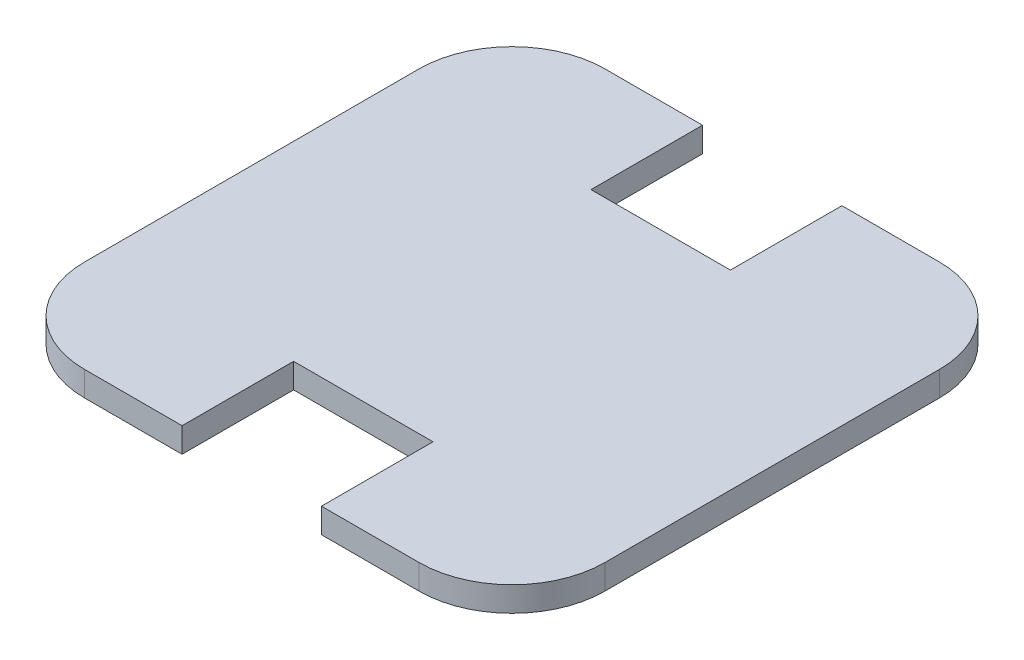
ISO-10303-21;
HEADER;
FILE_DESCRIPTION(('STEP AP214'),'2;1');
FILE_NAME('part.step','',(''),(''),'','','');
FILE_SCHEMA(('AUTOMOTIVE_DESIGN { 1 0 10303 214 1 1 1 1 }'));
ENDSEC;
DATA;
#1=APPLICATION_CONTEXT('core data for automotive mechanical design processes');
#2=APPLICATION_PROTOCOL_DEFINITION('international standard','automotive_design',2000,#1);
#3=PRODUCT_CONTEXT('',#1,'mechanical');
#4=PRODUCT('Part','Part','',(#3));
#5=PRODUCT_RELATED_PRODUCT_CATEGORY('part','',(#4));
#6=PRODUCT_DEFINITION_FORMATION('','',#4);
#7=PRODUCT_DEFINITION_CONTEXT('part definition',#1,'design');
#8=PRODUCT_DEFINITION('design','',#6,#7);
#9=PRODUCT_DEFINITION_SHAPE('','',#8);
#10=(LENGTH_UNIT() NAMED_UNIT(*) SI_UNIT(.MILLI.,.METRE.));
#11=(NAMED_UNIT(*) PLANE_ANGLE_UNIT() SI_UNIT($,.RADIAN.));
#12=(NAMED_UNIT(*) SI_UNIT($,.STERADIAN.) SOLID_ANGLE_UNIT());
#13=UNCERTAINTY_MEASURE_WITH_UNIT(LENGTH_MEASURE(1.E-05),#10,'distance_accuracy_value','');
#14=(GEOMETRIC_REPRESENTATION_CONTEXT(3) GLOBAL_UNCERTAINTY_ASSIGNED_CONTEXT((#13)) GLOBAL_UNIT_ASSIGNED_CONTEXT((#10,
#11,#12)) REPRESENTATION_CONTEXT('',''));
#15=CARTESIAN_POINT('',(0.,0.,0.));
#16=DIRECTION('',(0.,0.,1.));
#17=DIRECTION('',(1.,0.,0.));
#18=AXIS2_PLACEMENT_3D('',#15,#16,#17);
#19=CARTESIAN_POINT('',(-27.,4.,-27.));
#20=DIRECTION('',(0.,-1.,0.));
#21=DIRECTION('',(0.,0.,-1.));
#22=AXIS2_PLACEMENT_3D('',#19,#20,#21);
#23=CYLINDRICAL_SURFACE('',#22,15.);
#24=CARTESIAN_POINT('',(-27.,0.,-27.));
#25=DIRECTION('',(0.,1.,0.));
#26=DIRECTION('',(0.,0.,1.));
#27=AXIS2_PLACEMENT_3D('',#24,#25,#26);
#28=CIRCLE('',#27,15.);
#29=CARTESIAN_POINT('',(-42.,0.,-27.));
#30=VERTEX_POINT('',#29);
#31=CARTESIAN_POINT('',(-27.,0.,-42.));
#32=VERTEX_POINT('',#31);
#33=EDGE_CURVE('E177',#30,#32,#28,.F.);
#34=ORIENTED_EDGE('',*,*,#33,.F.);
#35=DIRECTION('',(0.,-1.,0.));
#36=VECTOR('',#35,1.);
#37=CARTESIAN_POINT('',(-42.,4.,-27.));
#38=LINE('',#37,#36);
#39=CARTESIAN_POINT('',(-42.,4.,-27.));
#40=VERTEX_POINT('',#39);
#41=EDGE_CURVE('E11',#40,#30,#38,.T.);
#42=ORIENTED_EDGE('',*,*,#41,.F.);
#43=CARTESIAN_POINT('',(-27.,4.,-27.));
#44=DIRECTION('',(0.,1.,0.));
#45=DIRECTION('',(0.,0.,1.));
#46=AXIS2_PLACEMENT_3D('',#43,#44,#45);
#47=CIRCLE('',#46,15.);
#48=CARTESIAN_POINT('',(-27.,4.,-42.));
#49=VERTEX_POINT('',#48);
#50=EDGE_CURVE('E217',#40,#49,#47,.F.);
#51=ORIENTED_EDGE('',*,*,#50,.T.);
#52=DIRECTION('',(0.,-1.,0.));
#53=VECTOR('',#52,1.);
#54=CARTESIAN_POINT('',(-27.,4.,-42.));
#55=LINE('',#54,#53);
#56=EDGE_CURVE('E52',#49,#32,#55,.T.);
#57=ORIENTED_EDGE('',*,*,#56,.T.);
#58=EDGE_LOOP('',(#34,#42,#51,#57));
#59=FACE_BOUND('',#58,.T.);
#60=ADVANCED_FACE('F36',(#59),#23,.T.);
#61=CARTESIAN_POINT('',(-42.,4.,0.));
#62=DIRECTION('',(-1.,0.,0.));
#63=DIRECTION('',(0.,0.,1.));
#64=AXIS2_PLACEMENT_3D('',#61,#62,#63);
#65=PLANE('',#64);
#66=DIRECTION('',(0.,0.,-1.));
#67=VECTOR('',#66,1.);
#68=CARTESIAN_POINT('',(-42.,0.,0.));
#69=LINE('',#68,#67);
#70=CARTESIAN_POINT('',(-42.,0.,27.));
#71=VERTEX_POINT('',#70);
#72=EDGE_CURVE('E179',#71,#30,#69,.T.);
#73=ORIENTED_EDGE('',*,*,#72,.F.);
#74=DIRECTION('',(0.,-1.,0.));
#75=VECTOR('',#74,1.);
#76=CARTESIAN_POINT('',(-42.,4.,27.));
#77=LINE('',#76,#75);
#78=CARTESIAN_POINT('',(-42.,4.,27.));
#79=VERTEX_POINT('',#78);
#80=EDGE_CURVE('E44',#79,#71,#77,.T.);
#81=ORIENTED_EDGE('',*,*,#80,.F.);
#82=DIRECTION('',(0.,0.,-1.));
#83=VECTOR('',#82,1.);
#84=CARTESIAN_POINT('',(-42.,4.,0.));
#85=LINE('',#84,#83);
#86=EDGE_CURVE('E476',#79,#40,#85,.T.);
#87=ORIENTED_EDGE('',*,*,#86,.T.);
#88=ORIENTED_EDGE('',*,*,#41,.T.);
#89=EDGE_LOOP('',(#73,#81,#87,#88));
#90=FACE_BOUND('',#89,.T.);
#91=ADVANCED_FACE('F254',(#90),#65,.T.);
#92=CARTESIAN_POINT('',(-27.,4.,27.));
#93=DIRECTION('',(0.,-1.,0.));
#94=DIRECTION('',(0.,0.,-1.));
#95=AXIS2_PLACEMENT_3D('',#92,#93,#94);
#96=CYLINDRICAL_SURFACE('',#95,15.);
#97=CARTESIAN_POINT('',(-27.,0.,27.));
#98=DIRECTION('',(0.,1.,0.));
#99=DIRECTION('',(0.,0.,1.));
#100=AXIS2_PLACEMENT_3D('',#97,#98,#99);
#101=CIRCLE('',#100,15.);
#102=CARTESIAN_POINT('',(-27.,0.,42.));
#103=VERTEX_POINT('',#102);
#104=EDGE_CURVE('E182',#103,#71,#101,.F.);
#105=ORIENTED_EDGE('',*,*,#104,.F.);
#106=DIRECTION('',(0.,-1.,0.));
#107=VECTOR('',#106,1.);
#108=CARTESIAN_POINT('',(-27.,4.,42.));
#109=LINE('',#108,#107);
#110=CARTESIAN_POINT('',(-27.,4.,42.));
#111=VERTEX_POINT('',#110);
#112=EDGE_CURVE('E243',#111,#103,#109,.T.);
#113=ORIENTED_EDGE('',*,*,#112,.F.);
#114=CARTESIAN_POINT('',(-27.,4.,27.));
#115=DIRECTION('',(0.,1.,0.));
#116=DIRECTION('',(0.,0.,1.));
#117=AXIS2_PLACEMENT_3D('',#114,#115,#116);
#118=CIRCLE('',#117,15.);
#119=EDGE_CURVE('E250',#111,#79,#118,.F.);
#120=ORIENTED_EDGE('',*,*,#119,.T.);
#121=ORIENTED_EDGE('',*,*,#80,.T.);
#122=EDGE_LOOP('',(#105,#113,#120,#121));
#123=FACE_BOUND('',#122,.T.);
#124=ADVANCED_FACE('F248',(#123),#96,.T.);
#125=CARTESIAN_POINT('',(0.,4.,42.));
#126=DIRECTION('',(0.,0.,-1.));
#127=DIRECTION('',(-1.,0.,0.));
#128=AXIS2_PLACEMENT_3D('',#125,#126,#127);
#129=PLANE('',#128);
#130=DIRECTION('',(1.,0.,0.));
#131=VECTOR('',#130,1.);
#132=CARTESIAN_POINT('',(0.,0.,42.));
#133=LINE('',#132,#131);
#134=CARTESIAN_POINT('',(-11.25,0.,42.));
#135=VERTEX_POINT('',#134);
#136=EDGE_CURVE('E185',#103,#135,#133,.T.);
#137=ORIENTED_EDGE('',*,*,#136,.T.);
#138=DIRECTION('',(0.,-1.,0.));
#139=VECTOR('',#138,1.);
#140=CARTESIAN_POINT('',(-11.25,4.,42.));
#141=LINE('',#140,#139);
#142=CARTESIAN_POINT('',(-11.25,4.,42.));
#143=VERTEX_POINT('',#142);
#144=EDGE_CURVE('E240',#143,#135,#141,.T.);
#145=ORIENTED_EDGE('',*,*,#144,.F.);
#146=DIRECTION('',(1.,0.,0.));
#147=VECTOR('',#146,1.);
#148=CARTESIAN_POINT('',(0.,4.,42.));
#149=LINE('',#148,#147);
#150=EDGE_CURVE('E271',#111,#143,#149,.T.);
#151=ORIENTED_EDGE('',*,*,#150,.F.);
#152=ORIENTED_EDGE('',*,*,#112,.T.);
#153=EDGE_LOOP('',(#137,#145,#151,#152));
#154=FACE_BOUND('',#153,.T.);
#155=ADVANCED_FACE('F262',(#154),#129,.F.);
#156=CARTESIAN_POINT('',(-11.25,4.,0.));
#157=DIRECTION('',(-1.,0.,0.));
#158=DIRECTION('',(0.,0.,1.));
#159=AXIS2_PLACEMENT_3D('',#156,#157,#158);
#160=PLANE('',#159);
#161=DIRECTION('',(0.,0.,-1.));
#162=VECTOR('',#161,1.);
#163=CARTESIAN_POINT('',(-11.25,0.,0.));
#164=LINE('',#163,#162);
#165=CARTESIAN_POINT('',(-11.25,0.,24.));
#166=VERTEX_POINT('',#165);
#167=EDGE_CURVE('E187',#135,#166,#164,.T.);
#168=ORIENTED_EDGE('',*,*,#167,.T.);
#169=DIRECTION('',(0.,-1.,0.));
#170=VECTOR('',#169,1.);
#171=CARTESIAN_POINT('',(-11.25,4.,24.));
#172=LINE('',#171,#170);
#173=CARTESIAN_POINT('',(-11.25,4.,24.));
#174=VERTEX_POINT('',#173);
#175=EDGE_CURVE('E237',#174,#166,#172,.T.);
#176=ORIENTED_EDGE('',*,*,#175,.F.);
#177=DIRECTION('',(0.,0.,-1.));
#178=VECTOR('',#177,1.);
#179=CARTESIAN_POINT('',(-11.25,4.,0.));
#180=LINE('',#179,#178);
#181=EDGE_CURVE('E268',#143,#174,#180,.T.);
#182=ORIENTED_EDGE('',*,*,#181,.F.);
#183=ORIENTED_EDGE('',*,*,#144,.T.);
#184=EDGE_LOOP('',(#168,#176,#182,#183));
#185=FACE_BOUND('',#184,.T.);
#186=ADVANCED_FACE('F266',(#185),#160,.F.);
#187=CARTESIAN_POINT('',(0.,4.,24.));
#188=DIRECTION('',(0.,0.,-1.));
#189=DIRECTION('',(-1.,0.,0.));
#190=AXIS2_PLACEMENT_3D('',#187,#188,#189);
#191=PLANE('',#190);
#192=DIRECTION('',(1.,0.,0.));
#193=VECTOR('',#192,1.);
#194=CARTESIAN_POINT('',(0.,0.,24.));
#195=LINE('',#194,#193);
#196=CARTESIAN_POINT('',(11.25,0.,24.));
#197=VERTEX_POINT('',#196);
#198=EDGE_CURVE('E189',#166,#197,#195,.T.);
#199=ORIENTED_EDGE('',*,*,#198,.T.);
#200=DIRECTION('',(0.,-1.,0.));
#201=VECTOR('',#200,1.);
#202=CARTESIAN_POINT('',(11.25,4.,24.));
#203=LINE('',#202,#201);
#204=CARTESIAN_POINT('',(11.25,4.,24.));
#205=VERTEX_POINT('',#204);
#206=EDGE_CURVE('E235',#205,#197,#203,.T.);
#207=ORIENTED_EDGE('',*,*,#206,.F.);
#208=DIRECTION('',(1.,0.,0.));
#209=VECTOR('',#208,1.);
#210=CARTESIAN_POINT('',(0.,4.,24.));
#211=LINE('',#210,#209);
#212=EDGE_CURVE('E270',#174,#205,#211,.T.);
#213=ORIENTED_EDGE('',*,*,#212,.F.);
#214=ORIENTED_EDGE('',*,*,#175,.T.);
#215=EDGE_LOOP('',(#199,#207,#213,#214));
#216=FACE_BOUND('',#215,.T.);
#217=ADVANCED_FACE('F409',(#216),#191,.F.);
#218=CARTESIAN_POINT('',(11.25,4.,0.));
#219=DIRECTION('',(-1.,0.,0.));
#220=DIRECTION('',(0.,0.,1.));
#221=AXIS2_PLACEMENT_3D('',#218,#219,#220);
#222=PLANE('',#221);
#223=DIRECTION('',(0.,0.,-1.));
#224=VECTOR('',#223,1.);
#225=CARTESIAN_POINT('',(11.25,0.,0.));
#226=LINE('',#225,#224);
#227=CARTESIAN_POINT('',(11.25,0.,42.));
#228=VERTEX_POINT('',#227);
#229=EDGE_CURVE('E192',#228,#197,#226,.T.);
#230=ORIENTED_EDGE('',*,*,#229,.F.);
#231=DIRECTION('',(0.,-1.,0.));
#232=VECTOR('',#231,1.);
#233=CARTESIAN_POINT('',(11.25,4.,42.));
#234=LINE('',#233,#232);
#235=CARTESIAN_POINT('',(11.25,4.,42.));
#236=VERTEX_POINT('',#235);
#237=EDGE_CURVE('E233',#236,#228,#234,.T.);
#238=ORIENTED_EDGE('',*,*,#237,.F.);
#239=DIRECTION('',(0.,0.,-1.));
#240=VECTOR('',#239,1.);
#241=CARTESIAN_POINT('',(11.25,4.,0.));
#242=LINE('',#241,#240);
#243=EDGE_CURVE('E273',#236,#205,#242,.T.);
#244=ORIENTED_EDGE('',*,*,#243,.T.);
#245=ORIENTED_EDGE('',*,*,#206,.T.);
#246=EDGE_LOOP('',(#230,#238,#244,#245));
#247=FACE_BOUND('',#246,.T.);
#248=ADVANCED_FACE('F399',(#247),#222,.T.);
#249=CARTESIAN_POINT('',(0.,4.,42.));
#250=DIRECTION('',(0.,0.,-1.));
#251=DIRECTION('',(-1.,0.,0.));
#252=AXIS2_PLACEMENT_3D('',#249,#250,#251);
#253=PLANE('',#252);
#254=DIRECTION('',(1.,0.,0.));
#255=VECTOR('',#254,1.);
#256=CARTESIAN_POINT('',(0.,0.,42.));
#257=LINE('',#256,#255);
#258=CARTESIAN_POINT('',(27.,0.,42.));
#259=VERTEX_POINT('',#258);
#260=EDGE_CURVE('E195',#228,#259,#257,.T.);
#261=ORIENTED_EDGE('',*,*,#260,.T.);
#262=DIRECTION('',(0.,-1.,0.));
#263=VECTOR('',#262,1.);
#264=CARTESIAN_POINT('',(27.,4.,42.));
#265=LINE('',#264,#263);
#266=CARTESIAN_POINT('',(27.,4.,42.));
#267=VERTEX_POINT('',#266);
#268=EDGE_CURVE('E230',#267,#259,#265,.T.);
#269=ORIENTED_EDGE('',*,*,#268,.F.);
#270=DIRECTION('',(1.,0.,0.));
#271=VECTOR('',#270,1.);
#272=CARTESIAN_POINT('',(0.,4.,42.));
#273=LINE('',#272,#271);
#274=EDGE_CURVE('E280',#236,#267,#273,.T.);
#275=ORIENTED_EDGE('',*,*,#274,.F.);
#276=ORIENTED_EDGE('',*,*,#237,.T.);
#277=EDGE_LOOP('',(#261,#269,#275,#276));
#278=FACE_BOUND('',#277,.T.);
#279=ADVANCED_FACE('F389',(#278),#253,.F.);
#280=CARTESIAN_POINT('',(27.,4.,27.));
#281=DIRECTION('',(0.,-1.,0.));
#282=DIRECTION('',(0.,0.,-1.));
#283=AXIS2_PLACEMENT_3D('',#280,#281,#282);
#284=CYLINDRICAL_SURFACE('',#283,15.);
#285=CARTESIAN_POINT('',(27.,0.,27.));
#286=DIRECTION('',(0.,1.,0.));
#287=DIRECTION('',(0.,0.,1.));
#288=AXIS2_PLACEMENT_3D('',#285,#286,#287);
#289=CIRCLE('',#288,15.);
#290=CARTESIAN_POINT('',(42.,0.,27.));
#291=VERTEX_POINT('',#290);
#292=EDGE_CURVE('E197',#259,#291,#289,.T.);
#293=ORIENTED_EDGE('',*,*,#292,.T.);
#294=DIRECTION('',(0.,-1.,0.));
#295=VECTOR('',#294,1.);
#296=CARTESIAN_POINT('',(42.,4.,27.));
#297=LINE('',#296,#295);
#298=CARTESIAN_POINT('',(42.,4.,27.));
#299=VERTEX_POINT('',#298);
#300=EDGE_CURVE('E227',#299,#291,#297,.T.);
#301=ORIENTED_EDGE('',*,*,#300,.F.);
#302=CARTESIAN_POINT('',(27.,4.,27.));
#303=DIRECTION('',(0.,1.,0.));
#304=DIRECTION('',(0.,0.,1.));
#305=AXIS2_PLACEMENT_3D('',#302,#303,#304);
#306=CIRCLE('',#305,15.);
#307=EDGE_CURVE('E282',#267,#299,#306,.T.);
#308=ORIENTED_EDGE('',*,*,#307,.F.);
#309=ORIENTED_EDGE('',*,*,#268,.T.);
#310=EDGE_LOOP('',(#293,#301,#308,#309));
#311=FACE_BOUND('',#310,.T.);
#312=ADVANCED_FACE('F379',(#311),#284,.T.);
#313=CARTESIAN_POINT('',(42.,4.,0.));
#314=DIRECTION('',(-1.,0.,0.));
#315=DIRECTION('',(0.,0.,1.));
#316=AXIS2_PLACEMENT_3D('',#313,#314,#315);
#317=PLANE('',#316);
#318=DIRECTION('',(0.,0.,-1.));
#319=VECTOR('',#318,1.);
#320=CARTESIAN_POINT('',(42.,0.,0.));
#321=LINE('',#320,#319);
#322=CARTESIAN_POINT('',(42.,0.,-27.));
#323=VERTEX_POINT('',#322);
#324=EDGE_CURVE('E199',#291,#323,#321,.T.);
#325=ORIENTED_EDGE('',*,*,#324,.T.);
#326=DIRECTION('',(0.,-1.,0.));
#327=VECTOR('',#326,1.);
#328=CARTESIAN_POINT('',(42.,4.,-27.));
#329=LINE('',#328,#327);
#330=CARTESIAN_POINT('',(42.,4.,-27.));
#331=VERTEX_POINT('',#330);
#332=EDGE_CURVE('E225',#331,#323,#329,.T.);
#333=ORIENTED_EDGE('',*,*,#332,.F.);
#334=DIRECTION('',(0.,0.,-1.));
#335=VECTOR('',#334,1.);
#336=CARTESIAN_POINT('',(42.,4.,0.));
#337=LINE('',#336,#335);
#338=EDGE_CURVE('E284',#299,#331,#337,.T.);
#339=ORIENTED_EDGE('',*,*,#338,.F.);
#340=ORIENTED_EDGE('',*,*,#300,.T.);
#341=EDGE_LOOP('',(#325,#333,#339,#340));
#342=FACE_BOUND('',#341,.T.);
#343=ADVANCED_FACE('F370',(#342),#317,.F.);
#344=CARTESIAN_POINT('',(27.,4.,-27.));
#345=DIRECTION('',(0.,-1.,0.));
#346=DIRECTION('',(0.,0.,-1.));
#347=AXIS2_PLACEMENT_3D('',#344,#345,#346);
#348=CYLINDRICAL_SURFACE('',#347,15.);
#349=CARTESIAN_POINT('',(27.,0.,-27.));
#350=DIRECTION('',(0.,1.,0.));
#351=DIRECTION('',(0.,0.,1.));
#352=AXIS2_PLACEMENT_3D('',#349,#350,#351);
#353=CIRCLE('',#352,15.);
#354=CARTESIAN_POINT('',(27.,0.,-42.));
#355=VERTEX_POINT('',#354);
#356=EDGE_CURVE('E202',#355,#323,#353,.F.);
#357=ORIENTED_EDGE('',*,*,#356,.F.);
#358=DIRECTION('',(0.,-1.,0.));
#359=VECTOR('',#358,1.);
#360=CARTESIAN_POINT('',(27.,4.,-42.));
#361=LINE('',#360,#359);
#362=CARTESIAN_POINT('',(27.,4.,-42.));
#363=VERTEX_POINT('',#362);
#364=EDGE_CURVE('E223',#363,#355,#361,.T.);
#365=ORIENTED_EDGE('',*,*,#364,.F.);
#366=CARTESIAN_POINT('',(27.,4.,-27.));
#367=DIRECTION('',(0.,1.,0.));
#368=DIRECTION('',(0.,0.,1.));
#369=AXIS2_PLACEMENT_3D('',#366,#367,#368);
#370=CIRCLE('',#369,15.);
#371=EDGE_CURVE('E286',#363,#331,#370,.F.);
#372=ORIENTED_EDGE('',*,*,#371,.T.);
#373=ORIENTED_EDGE('',*,*,#332,.T.);
#374=EDGE_LOOP('',(#357,#365,#372,#373));
#375=FACE_BOUND('',#374,.T.);
#376=ADVANCED_FACE('F299',(#375),#348,.T.);
#377=CARTESIAN_POINT('',(0.,4.,-42.));
#378=DIRECTION('',(0.,0.,-1.));
#379=DIRECTION('',(-1.,0.,0.));
#380=AXIS2_PLACEMENT_3D('',#377,#378,#379);
#381=PLANE('',#380);
#382=DIRECTION('',(1.,0.,0.));
#383=VECTOR('',#382,1.);
#384=CARTESIAN_POINT('',(0.,0.,-42.));
#385=LINE('',#384,#383);
#386=CARTESIAN_POINT('',(11.25,0.,-42.));
#387=VERTEX_POINT('',#386);
#388=EDGE_CURVE('E205',#387,#355,#385,.T.);
#389=ORIENTED_EDGE('',*,*,#388,.F.);
#390=DIRECTION('',(0.,-1.,0.));
#391=VECTOR('',#390,1.);
#392=CARTESIAN_POINT('',(11.25,4.,-42.));
#393=LINE('',#392,#391);
#394=CARTESIAN_POINT('',(11.25,4.,-42.));
#395=VERTEX_POINT('',#394);
#396=EDGE_CURVE('E221',#395,#387,#393,.T.);
#397=ORIENTED_EDGE('',*,*,#396,.F.);
#398=DIRECTION('',(1.,0.,0.));
#399=VECTOR('',#398,1.);
#400=CARTESIAN_POINT('',(0.,4.,-42.));
#401=LINE('',#400,#399);
#402=EDGE_CURVE('E289',#395,#363,#401,.T.);
#403=ORIENTED_EDGE('',*,*,#402,.T.);
#404=ORIENTED_EDGE('',*,*,#364,.T.);
#405=EDGE_LOOP('',(#389,#397,#403,#404));
#406=FACE_BOUND('',#405,.T.);
#407=ADVANCED_FACE('F293',(#406),#381,.T.);
#408=CARTESIAN_POINT('',(11.25,4.,0.));
#409=DIRECTION('',(1.,0.,0.));
#410=DIRECTION('',(0.,0.,-1.));
#411=AXIS2_PLACEMENT_3D('',#408,#409,#410);
#412=PLANE('',#411);
#413=DIRECTION('',(0.,0.,1.));
#414=VECTOR('',#413,1.);
#415=CARTESIAN_POINT('',(11.25,0.,0.));
#416=LINE('',#415,#414);
#417=CARTESIAN_POINT('',(11.25,0.,-24.));
#418=VERTEX_POINT('',#417);
#419=EDGE_CURVE('E208',#387,#418,#416,.T.);
#420=ORIENTED_EDGE('',*,*,#419,.T.);
#421=DIRECTION('',(0.,-1.,0.));
#422=VECTOR('',#421,1.);
#423=CARTESIAN_POINT('',(11.25,4.,-24.));
#424=LINE('',#423,#422);
#425=CARTESIAN_POINT('',(11.25,4.,-24.));
#426=VERTEX_POINT('',#425);
#427=EDGE_CURVE('E159',#426,#418,#424,.T.);
#428=ORIENTED_EDGE('',*,*,#427,.F.);
#429=DIRECTION('',(0.,0.,1.));
#430=VECTOR('',#429,1.);
#431=CARTESIAN_POINT('',(11.25,4.,0.));
#432=LINE('',#431,#430);
#433=EDGE_CURVE('E168',#395,#426,#432,.T.);
#434=ORIENTED_EDGE('',*,*,#433,.F.);
#435=ORIENTED_EDGE('',*,*,#396,.T.);
#436=EDGE_LOOP('',(#420,#428,#434,#435));
#437=FACE_BOUND('',#436,.T.);
#438=ADVANCED_FACE('F303',(#437),#412,.F.);
#439=CARTESIAN_POINT('',(0.,4.,-24.));
#440=DIRECTION('',(0.,0.,-1.));
#441=DIRECTION('',(-1.,0.,0.));
#442=AXIS2_PLACEMENT_3D('',#439,#440,#441);
#443=PLANE('',#442);
#444=DIRECTION('',(1.,0.,0.));
#445=VECTOR('',#444,1.);
#446=CARTESIAN_POINT('',(0.,0.,-24.));
#447=LINE('',#446,#445);
#448=CARTESIAN_POINT('',(-11.25,0.,-24.));
#449=VERTEX_POINT('',#448);
#450=EDGE_CURVE('E155',#449,#418,#447,.T.);
#451=ORIENTED_EDGE('',*,*,#450,.F.);
#452=DIRECTION('',(0.,-1.,0.));
#453=VECTOR('',#452,1.);
#454=CARTESIAN_POINT('',(-11.25,4.,-24.));
#455=LINE('',#454,#453);
#456=CARTESIAN_POINT('',(-11.25,4.,-24.));
#457=VERTEX_POINT('',#456);
#458=EDGE_CURVE('E150',#457,#449,#455,.T.);
#459=ORIENTED_EDGE('',*,*,#458,.F.);
#460=DIRECTION('',(1.,0.,0.));
#461=VECTOR('',#460,1.);
#462=CARTESIAN_POINT('',(0.,4.,-24.));
#463=LINE('',#462,#461);
#464=EDGE_CURVE('E153',#457,#426,#463,.T.);
#465=ORIENTED_EDGE('',*,*,#464,.T.);
#466=ORIENTED_EDGE('',*,*,#427,.T.);
#467=EDGE_LOOP('',(#451,#459,#465,#466));
#468=FACE_BOUND('',#467,.T.);
#469=ADVANCED_FACE('F152',(#468),#443,.T.);
#470=CARTESIAN_POINT('',(-11.25,4.,0.));
#471=DIRECTION('',(1.,0.,0.));
#472=DIRECTION('',(0.,0.,-1.));
#473=AXIS2_PLACEMENT_3D('',#470,#471,#472);
#474=PLANE('',#473);
#475=DIRECTION('',(0.,0.,1.));
#476=VECTOR('',#475,1.);
#477=CARTESIAN_POINT('',(-11.25,0.,0.));
#478=LINE('',#477,#476);
#479=CARTESIAN_POINT('',(-11.25,0.,-42.));
#480=VERTEX_POINT('',#479);
#481=EDGE_CURVE('E212',#480,#449,#478,.T.);
#482=ORIENTED_EDGE('',*,*,#481,.F.);
#483=DIRECTION('',(0.,-1.,0.));
#484=VECTOR('',#483,1.);
#485=CARTESIAN_POINT('',(-11.25,4.,-42.));
#486=LINE('',#485,#484);
#487=CARTESIAN_POINT('',(-11.25,4.,-42.));
#488=VERTEX_POINT('',#487);
#489=EDGE_CURVE('E101',#488,#480,#486,.T.);
#490=ORIENTED_EDGE('',*,*,#489,.F.);
#491=DIRECTION('',(0.,0.,1.));
#492=VECTOR('',#491,1.);
#493=CARTESIAN_POINT('',(-11.25,4.,0.));
#494=LINE('',#493,#492);
#495=EDGE_CURVE('E165',#488,#457,#494,.T.);
#496=ORIENTED_EDGE('',*,*,#495,.T.);
#497=ORIENTED_EDGE('',*,*,#458,.T.);
#498=EDGE_LOOP('',(#482,#490,#496,#497));
#499=FACE_BOUND('',#498,.T.);
#500=ADVANCED_FACE('F171',(#499),#474,.T.);
#501=CARTESIAN_POINT('',(0.,4.,-42.));
#502=DIRECTION('',(0.,0.,-1.));
#503=DIRECTION('',(-1.,0.,0.));
#504=AXIS2_PLACEMENT_3D('',#501,#502,#503);
#505=PLANE('',#504);
#506=DIRECTION('',(1.,0.,0.));
#507=VECTOR('',#506,1.);
#508=CARTESIAN_POINT('',(0.,0.,-42.));
#509=LINE('',#508,#507);
#510=EDGE_CURVE('E214',#32,#480,#509,.T.);
#511=ORIENTED_EDGE('',*,*,#510,.F.);
#512=ORIENTED_EDGE('',*,*,#56,.F.);
#513=DIRECTION('',(1.,0.,0.));
#514=VECTOR('',#513,1.);
#515=CARTESIAN_POINT('',(0.,4.,-42.));
#516=LINE('',#515,#514);
#517=EDGE_CURVE('E172',#49,#488,#516,.T.);
#518=ORIENTED_EDGE('',*,*,#517,.T.);
#519=ORIENTED_EDGE('',*,*,#489,.T.);
#520=EDGE_LOOP('',(#511,#512,#518,#519));
#521=FACE_BOUND('',#520,.T.);
#522=ADVANCED_FACE('F316',(#521),#505,.T.);
#523=CARTESIAN_POINT('',(0.,4.,0.));
#524=DIRECTION('',(0.,1.,0.));
#525=DIRECTION('',(0.,0.,1.));
#526=AXIS2_PLACEMENT_3D('',#523,#524,#525);
#527=PLANE('',#526);
#528=ORIENTED_EDGE('',*,*,#50,.F.);
#529=ORIENTED_EDGE('',*,*,#86,.F.);
#530=ORIENTED_EDGE('',*,*,#119,.F.);
#531=ORIENTED_EDGE('',*,*,#150,.T.);
#532=ORIENTED_EDGE('',*,*,#181,.T.);
#533=ORIENTED_EDGE('',*,*,#212,.T.);
#534=ORIENTED_EDGE('',*,*,#243,.F.);
#535=ORIENTED_EDGE('',*,*,#274,.T.);
#536=ORIENTED_EDGE('',*,*,#307,.T.);
#537=ORIENTED_EDGE('',*,*,#338,.T.);
#538=ORIENTED_EDGE('',*,*,#371,.F.);
#539=ORIENTED_EDGE('',*,*,#402,.F.);
#540=ORIENTED_EDGE('',*,*,#433,.T.);
#541=ORIENTED_EDGE('',*,*,#464,.F.);
#542=ORIENTED_EDGE('',*,*,#495,.F.);
#543=ORIENTED_EDGE('',*,*,#517,.F.);
#544=EDGE_LOOP('',(#528,#529,#530,#531,#532,#533,#534,#535,#536,#537,#538,#539,#540,#541,#542,#543));
#545=FACE_BOUND('',#544,.T.);
#546=ADVANCED_FACE('F163',(#545),#527,.T.);
#547=CARTESIAN_POINT('',(0.,0.,0.));
#548=DIRECTION('',(0.,1.,0.));
#549=DIRECTION('',(0.,0.,1.));
#550=AXIS2_PLACEMENT_3D('',#547,#548,#549);
#551=PLANE('',#550);
#552=ORIENTED_EDGE('',*,*,#33,.T.);
#553=ORIENTED_EDGE('',*,*,#510,.T.);
#554=ORIENTED_EDGE('',*,*,#481,.T.);
#555=ORIENTED_EDGE('',*,*,#450,.T.);
#556=ORIENTED_EDGE('',*,*,#419,.F.);
#557=ORIENTED_EDGE('',*,*,#388,.T.);
#558=ORIENTED_EDGE('',*,*,#356,.T.);
#559=ORIENTED_EDGE('',*,*,#324,.F.);
#560=ORIENTED_EDGE('',*,*,#292,.F.);
#561=ORIENTED_EDGE('',*,*,#260,.F.);
#562=ORIENTED_EDGE('',*,*,#229,.T.);
#563=ORIENTED_EDGE('',*,*,#198,.F.);
#564=ORIENTED_EDGE('',*,*,#167,.F.);
#565=ORIENTED_EDGE('',*,*,#136,.F.);
#566=ORIENTED_EDGE('',*,*,#104,.T.);
#567=ORIENTED_EDGE('',*,*,#72,.T.);
#568=EDGE_LOOP('',(#552,#553,#554,#555,#556,#557,#558,#559,#560,#561,#562,#563,#564,#565,#566,#567));
#569=FACE_BOUND('',#568,.T.);
#570=ADVANCED_FACE('F257',(#569),#551,.F.);
#571=CLOSED_SHELL('',(#60,#91,#124,#155,#186,#217,#248,#279,#312,#343,#376,#407,#438,#469,#500,
#522,#546,#570));
#572=MANIFOLD_SOLID_BREP('B2',#571);
#573=ADVANCED_BREP_SHAPE_REPRESENTATION('',(#18,#572),#14);
#574=SHAPE_DEFINITION_REPRESENTATION(#9,#573);
ENDSEC;
END-ISO-10303-21;
